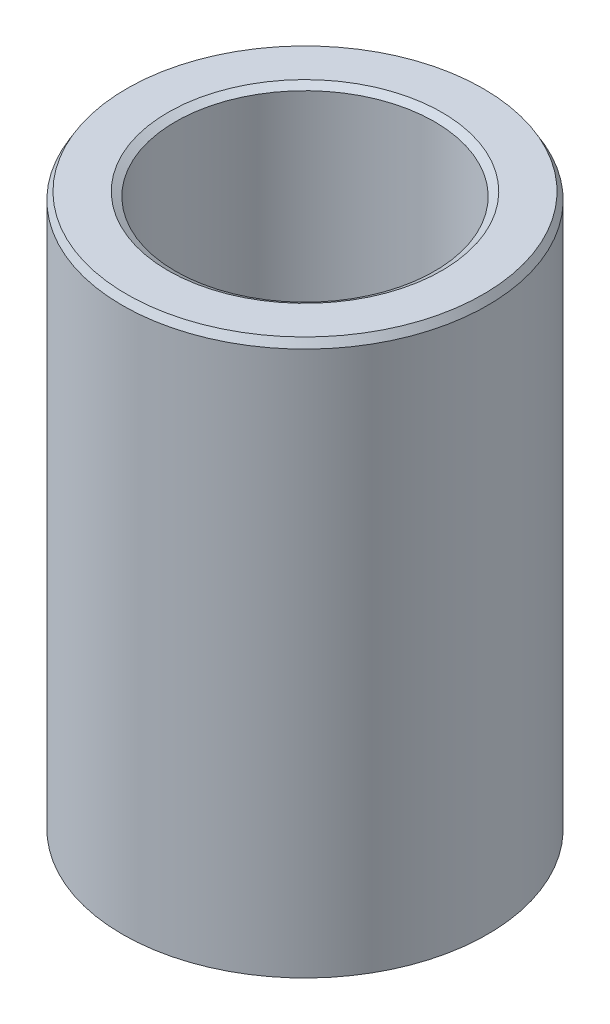
ISO-10303-21;
HEADER;
FILE_DESCRIPTION(('STEP AP214'),'2;1');
FILE_NAME('part.step','',(''),(''),'','','');
FILE_SCHEMA(('AUTOMOTIVE_DESIGN { 1 0 10303 214 1 1 1 1 }'));
ENDSEC;
DATA;
#1=APPLICATION_CONTEXT('core data for automotive mechanical design processes');
#2=APPLICATION_PROTOCOL_DEFINITION('international standard','automotive_design',2000,#1);
#3=PRODUCT_CONTEXT('',#1,'mechanical');
#4=PRODUCT('Part','Part','',(#3));
#5=PRODUCT_RELATED_PRODUCT_CATEGORY('part','',(#4));
#6=PRODUCT_DEFINITION_FORMATION('','',#4);
#7=PRODUCT_DEFINITION_CONTEXT('part definition',#1,'design');
#8=PRODUCT_DEFINITION('design','',#6,#7);
#9=PRODUCT_DEFINITION_SHAPE('','',#8);
#10=(LENGTH_UNIT() NAMED_UNIT(*) SI_UNIT(.MILLI.,.METRE.));
#11=(NAMED_UNIT(*) PLANE_ANGLE_UNIT() SI_UNIT($,.RADIAN.));
#12=(NAMED_UNIT(*) SI_UNIT($,.STERADIAN.) SOLID_ANGLE_UNIT());
#13=UNCERTAINTY_MEASURE_WITH_UNIT(LENGTH_MEASURE(1.E-05),#10,'distance_accuracy_value','');
#14=(GEOMETRIC_REPRESENTATION_CONTEXT(3) GLOBAL_UNCERTAINTY_ASSIGNED_CONTEXT((#13)) GLOBAL_UNIT_ASSIGNED_CONTEXT((#10,
#11,#12)) REPRESENTATION_CONTEXT('',''));
#15=CARTESIAN_POINT('',(0.,0.,0.));
#16=DIRECTION('',(0.,0.,1.));
#17=DIRECTION('',(1.,0.,0.));
#18=AXIS2_PLACEMENT_3D('',#15,#16,#17);
#19=CARTESIAN_POINT('',(0.,60.9600163009344,0.));
#20=DIRECTION('',(0.,-1.,0.));
#21=DIRECTION('',(0.,0.,-1.));
#22=AXIS2_PLACEMENT_3D('',#19,#20,#21);
#23=CYLINDRICAL_SURFACE('',#22,20.);
#24=CARTESIAN_POINT('',(0.,0.472863815361525,0.));
#25=DIRECTION('',(0.,1.,0.));
#26=DIRECTION('',(0.,0.,1.));
#27=AXIS2_PLACEMENT_3D('',#24,#25,#26);
#28=CIRCLE('',#27,20.);
#29=CARTESIAN_POINT('',(0.,0.472863815361525,20.));
#30=VERTEX_POINT('',#29);
#31=EDGE_CURVE('E10',#30,#30,#28,.T.);
#32=ORIENTED_EDGE('',*,*,#31,.T.);
#33=EDGE_LOOP('',(#32));
#34=FACE_BOUND('',#33,.T.);
#35=CARTESIAN_POINT('',(0.,60.1409921476673,0.));
#36=DIRECTION('',(0.,1.,0.));
#37=DIRECTION('',(0.,0.,1.));
#38=AXIS2_PLACEMENT_3D('',#35,#36,#37);
#39=CIRCLE('',#38,20.);
#40=CARTESIAN_POINT('',(0.,60.1409921476673,-20.));
#41=VERTEX_POINT('',#40);
#42=EDGE_CURVE('E50',#41,#41,#39,.F.);
#43=ORIENTED_EDGE('',*,*,#42,.T.);
#44=EDGE_LOOP('',(#43));
#45=FACE_BOUND('',#44,.T.);
#46=ADVANCED_FACE('F39',(#34,#45),#23,.T.);
#47=CARTESIAN_POINT('',(0.,60.9600163009344,0.));
#48=DIRECTION('',(0.,1.,0.));
#49=DIRECTION('',(0.,0.,1.));
#50=AXIS2_PLACEMENT_3D('',#47,#48,#49);
#51=PLANE('',#50);
#52=CARTESIAN_POINT('',(0.,60.9600163009344,0.));
#53=DIRECTION('',(0.,1.,0.));
#54=DIRECTION('',(0.,0.,1.));
#55=AXIS2_PLACEMENT_3D('',#52,#53,#54);
#56=CIRCLE('',#55,15.0113617959126);
#57=CARTESIAN_POINT('',(0.,60.9600163009344,15.0113617959126));
#58=VERTEX_POINT('',#57);
#59=EDGE_CURVE('E58',#58,#58,#56,.F.);
#60=ORIENTED_EDGE('',*,*,#59,.T.);
#61=EDGE_LOOP('',(#60));
#62=FACE_BOUND('',#61,.T.);
#63=CARTESIAN_POINT('',(0.,60.9600163009344,0.));
#64=DIRECTION('',(0.,1.,0.));
#65=DIRECTION('',(0.,0.,1.));
#66=AXIS2_PLACEMENT_3D('',#63,#64,#65);
#67=CIRCLE('',#66,19.5271361846385);
#68=CARTESIAN_POINT('',(0.,60.9600163009344,-19.5271361846385));
#69=VERTEX_POINT('',#68);
#70=EDGE_CURVE('E61',#69,#69,#67,.T.);
#71=ORIENTED_EDGE('',*,*,#70,.T.);
#72=EDGE_LOOP('',(#71));
#73=FACE_BOUND('',#72,.T.);
#74=ADVANCED_FACE('F88',(#62,#73),#51,.T.);
#75=CARTESIAN_POINT('',(0.,0.,0.));
#76=DIRECTION('',(0.,1.,0.));
#77=DIRECTION('',(0.,0.,1.));
#78=AXIS2_PLACEMENT_3D('',#75,#76,#77);
#79=PLANE('',#78);
#80=CARTESIAN_POINT('',(0.,0.,0.));
#81=DIRECTION('',(0.,1.,0.));
#82=DIRECTION('',(0.,0.,1.));
#83=AXIS2_PLACEMENT_3D('',#80,#81,#82);
#84=CIRCLE('',#83,14.6652014580071);
#85=CARTESIAN_POINT('',(0.,0.,-14.6652014580071));
#86=VERTEX_POINT('',#85);
#87=EDGE_CURVE('E51',#86,#86,#84,.T.);
#88=ORIENTED_EDGE('',*,*,#87,.T.);
#89=EDGE_LOOP('',(#88));
#90=FACE_BOUND('',#89,.T.);
#91=CARTESIAN_POINT('',(0.,0.,0.));
#92=DIRECTION('',(0.,1.,0.));
#93=DIRECTION('',(0.,0.,1.));
#94=AXIS2_PLACEMENT_3D('',#91,#92,#93);
#95=CIRCLE('',#94,19.180975846733);
#96=CARTESIAN_POINT('',(0.,0.,19.180975846733));
#97=VERTEX_POINT('',#96);
#98=EDGE_CURVE('E54',#97,#97,#95,.F.);
#99=ORIENTED_EDGE('',*,*,#98,.T.);
#100=EDGE_LOOP('',(#99));
#101=FACE_BOUND('',#100,.T.);
#102=ADVANCED_FACE('F83',(#90,#101),#79,.F.);
#103=CARTESIAN_POINT('',(0.,60.9600163009344,0.));
#104=DIRECTION('',(0.,-1.,0.));
#105=DIRECTION('',(0.,0.,-1.));
#106=AXIS2_PLACEMENT_3D('',#103,#104,#105);
#107=CYLINDRICAL_SURFACE('',#106,14.1923376426456);
#108=CARTESIAN_POINT('',(0.,60.4871524855729,0.));
#109=DIRECTION('',(0.,1.,0.));
#110=DIRECTION('',(0.,0.,1.));
#111=AXIS2_PLACEMENT_3D('',#108,#109,#110);
#112=CIRCLE('',#111,14.1923376426456);
#113=CARTESIAN_POINT('',(0.,60.4871524855729,14.1923376426456));
#114=VERTEX_POINT('',#113);
#115=EDGE_CURVE('E67',#114,#114,#112,.T.);
#116=ORIENTED_EDGE('',*,*,#115,.T.);
#117=EDGE_LOOP('',(#116));
#118=FACE_BOUND('',#117,.T.);
#119=CARTESIAN_POINT('',(0.,0.819024153267053,0.));
#120=DIRECTION('',(0.,1.,0.));
#121=DIRECTION('',(0.,0.,1.));
#122=AXIS2_PLACEMENT_3D('',#119,#120,#121);
#123=CIRCLE('',#122,14.1923376426456);
#124=CARTESIAN_POINT('',(0.,0.819024153267053,-14.1923376426456));
#125=VERTEX_POINT('',#124);
#126=EDGE_CURVE('E69',#125,#125,#123,.F.);
#127=ORIENTED_EDGE('',*,*,#126,.T.);
#128=EDGE_LOOP('',(#127));
#129=FACE_BOUND('',#128,.T.);
#130=ADVANCED_FACE('F71',(#118,#129),#107,.F.);
#131=CARTESIAN_POINT('',(0.,60.4871524855729,0.));
#132=DIRECTION('',(0.,1.,0.));
#133=DIRECTION('',(0.,0.,1.));
#134=AXIS2_PLACEMENT_3D('',#131,#132,#133);
#135=CONICAL_SURFACE('',#134,14.1923376426456,1.0471975511966);
#136=ORIENTED_EDGE('',*,*,#59,.F.);
#137=EDGE_LOOP('',(#136));
#138=FACE_BOUND('',#137,.T.);
#139=ORIENTED_EDGE('',*,*,#115,.F.);
#140=EDGE_LOOP('',(#139));
#141=FACE_BOUND('',#140,.T.);
#142=ADVANCED_FACE('F77',(#138,#141),#135,.F.);
#143=CARTESIAN_POINT('',(0.,0.,0.));
#144=DIRECTION('',(0.,-1.,0.));
#145=DIRECTION('',(0.,0.,-1.));
#146=AXIS2_PLACEMENT_3D('',#143,#144,#145);
#147=CONICAL_SURFACE('',#146,14.6652014580071,0.523598775598293);
#148=CARTESIAN_POINT('',(0.,0.819024153267053,-14.1923376426456));
#149=CARTESIAN_POINT('',(0.,0.810492651670521,-14.197263307389));
#150=CARTESIAN_POINT('',(0.,0.80196115007399,-14.2021889721323));
#151=CARTESIAN_POINT('',(0.,0.784898146880926,-14.212040301619));
#152=CARTESIAN_POINT('',(0.,0.776366645284394,-14.2169659663624));
#153=CARTESIAN_POINT('',(0.,0.759303642091331,-14.2268172958491));
#154=CARTESIAN_POINT('',(0.,0.750772140494799,-14.2317429605924));
#155=CARTESIAN_POINT('',(0.,0.733709137301735,-14.2415942900791));
#156=CARTESIAN_POINT('',(0.,0.725177635705203,-14.2465199548225));
#157=CARTESIAN_POINT('',(0.,0.70811463251214,-14.2563712843092));
#158=CARTESIAN_POINT('',(0.,0.699583130915608,-14.2612969490525));
#159=CARTESIAN_POINT('',(0.,0.682520127722544,-14.2711482785392));
#160=CARTESIAN_POINT('',(0.,0.673988626126013,-14.2760739432826));
#161=CARTESIAN_POINT('',(0.,0.656925622932949,-14.2859252727693));
#162=CARTESIAN_POINT('',(0.,0.648394121336417,-14.2908509375126));
#163=CARTESIAN_POINT('',(0.,0.631331118143353,-14.3007022669993));
#164=CARTESIAN_POINT('',(0.,0.622799616546822,-14.3056279317427));
#165=CARTESIAN_POINT('',(0.,0.605736613353758,-14.3154792612293));
#166=CARTESIAN_POINT('',(0.,0.597205111757226,-14.3204049259727));
#167=CARTESIAN_POINT('',(0.,0.580142108564163,-14.3302562554594));
#168=CARTESIAN_POINT('',(0.,0.571610606967631,-14.3351819202027));
#169=CARTESIAN_POINT('',(0.,0.554547603774567,-14.3450332496894));
#170=CARTESIAN_POINT('',(0.,0.546016102178035,-14.3499589144328));
#171=CARTESIAN_POINT('',(0.,0.528953098984972,-14.3598102439195));
#172=CARTESIAN_POINT('',(0.,0.52042159738844,-14.3647359086628));
#173=CARTESIAN_POINT('',(0.,0.503358594195377,-14.3745872381495));
#174=CARTESIAN_POINT('',(0.,0.494827092598845,-14.3795129028929));
#175=CARTESIAN_POINT('',(0.,0.477764089405781,-14.3893642323796));
#176=CARTESIAN_POINT('',(0.,0.469232587809249,-14.3942898971229));
#177=CARTESIAN_POINT('',(0.,0.452169584616185,-14.4041412266096));
#178=CARTESIAN_POINT('',(0.,0.443638083019654,-14.409066891353));
#179=CARTESIAN_POINT('',(0.,0.42657507982659,-14.4189182208397));
#180=CARTESIAN_POINT('',(0.,0.418043578230058,-14.423843885583));
#181=CARTESIAN_POINT('',(0.,0.400980575036995,-14.4336952150697));
#182=CARTESIAN_POINT('',(0.,0.392449073440463,-14.4386208798131));
#183=CARTESIAN_POINT('',(0.,0.375386070247399,-14.4484722092998));
#184=CARTESIAN_POINT('',(0.,0.366854568650868,-14.4533978740431));
#185=CARTESIAN_POINT('',(0.,0.349791565457804,-14.4632492035298));
#186=CARTESIAN_POINT('',(0.,0.341260063861272,-14.4681748682732));
#187=CARTESIAN_POINT('',(0.,0.324197060668208,-14.4780261977599));
#188=CARTESIAN_POINT('',(0.,0.315665559071677,-14.4829518625032));
#189=CARTESIAN_POINT('',(0.,0.298602555878613,-14.4928031919899));
#190=CARTESIAN_POINT('',(0.,0.290071054282082,-14.4977288567333));
#191=CARTESIAN_POINT('',(0.,0.273008051089018,-14.50758018622));
#192=CARTESIAN_POINT('',(0.,0.264476549492486,-14.5125058509633));
#193=CARTESIAN_POINT('',(0.,0.247413546299422,-14.52235718045));
#194=CARTESIAN_POINT('',(0.,0.23888204470289,-14.5272828451934));
#195=CARTESIAN_POINT('',(0.,0.221819041509827,-14.5371341746801));
#196=CARTESIAN_POINT('',(0.,0.213287539913295,-14.5420598394234));
#197=CARTESIAN_POINT('',(0.,0.196224536720231,-14.5519111689101));
#198=CARTESIAN_POINT('',(0.,0.1876930351237,-14.5568368336535));
#199=CARTESIAN_POINT('',(0.,0.170630031930636,-14.5666881631402));
#200=CARTESIAN_POINT('',(0.,0.162098530334104,-14.5716138278835));
#201=CARTESIAN_POINT('',(0.,0.145035527141041,-14.5814651573702));
#202=CARTESIAN_POINT('',(0.,0.136504025544509,-14.5863908221136));
#203=CARTESIAN_POINT('',(0.,0.119441022351445,-14.5962421516003));
#204=CARTESIAN_POINT('',(0.,0.110909520754913,-14.6011678163436));
#205=CARTESIAN_POINT('',(0.,0.0938465175618499,-14.6110191458303));
#206=CARTESIAN_POINT('',(0.,0.085315015965318,-14.6159448105737));
#207=CARTESIAN_POINT('',(0.,0.0682520127722545,-14.6257961400604));
#208=CARTESIAN_POINT('',(0.,0.0597205111757228,-14.6307218048037));
#209=CARTESIAN_POINT('',(0.,0.0426575079826591,-14.6405731342904));
#210=CARTESIAN_POINT('',(0.,0.0341260063861272,-14.6454987990338));
#211=CARTESIAN_POINT('',(0.,0.0170630031930634,-14.6553501285204));
#212=CARTESIAN_POINT('',(0.,0.00853150159653144,-14.6602757932638));
#213=CARTESIAN_POINT('',(0.,0.,-14.6652014580071));
#214=B_SPLINE_CURVE_WITH_KNOTS('',3,(#148,#149,#150,#151,#152,#153,#154,#155,#156,#157,#158,
#159,#160,#161,#162,#163,#164,#165,#166,#167,#168,#169,#170,#171,#172,#173,#174,#175,#176,#177,
#178,#179,#180,#181,#182,#183,#184,#185,#186,#187,#188,#189,#190,#191,#192,#193,#194,#195,#196,
#197,#198,#199,#200,#201,#202,#203,#204,#205,#206,#207,#208,#209,#210,#211,#212,#213),
.UNSPECIFIED.,.F.,.F.,(4,2,2,2,2,2,2,2,2,2,2,2,2,2,2,2,2,2,2,2,2,2,2,2,2,2,2,2,2,2,2,2,4),(0.,
0.0295539884600963,0.0591079769201926,0.088661965380288,0.118215953840384,0.147769942300481,
0.177323930760577,0.206877919220672,0.236431907680768,0.265985896140865,0.295539884600961,
0.325093873061057,0.354647861521153,0.384201849981249,0.413755838441345,0.443309826901441,
0.472863815361537,0.502417803821633,0.53197179228173,0.561525780741825,0.591079769201921,
0.620633757662018,0.650187746122113,0.67974173458221,0.709295723042306,0.738849711502402,
0.768403699962498,0.797957688422594,0.82751167688269,0.857065665342786,0.886619653802883,
0.916173642262978,0.945727630723075),.UNSPECIFIED.);
#215=EDGE_CURVE('BSEAM73',#125,#86,#214,.T.);
#216=ORIENTED_EDGE('',*,*,#126,.F.);
#217=ORIENTED_EDGE('',*,*,#87,.F.);
#218=ORIENTED_EDGE('',*,*,#215,.T.);
#219=ORIENTED_EDGE('',*,*,#215,.F.);
#220=EDGE_LOOP('',(#216,#218,#217,#219));
#221=FACE_BOUND('',#220,.T.);
#222=ADVANCED_FACE('F73',(#221),#147,.F.);
#223=CARTESIAN_POINT('',(0.,0.472863815361525,0.));
#224=DIRECTION('',(0.,1.,0.));
#225=DIRECTION('',(0.,0.,1.));
#226=AXIS2_PLACEMENT_3D('',#223,#224,#225);
#227=CONICAL_SURFACE('',#226,20.,1.0471975511966);
#228=ORIENTED_EDGE('',*,*,#98,.F.);
#229=EDGE_LOOP('',(#228));
#230=FACE_BOUND('',#229,.T.);
#231=ORIENTED_EDGE('',*,*,#31,.F.);
#232=EDGE_LOOP('',(#231));
#233=FACE_BOUND('',#232,.T.);
#234=ADVANCED_FACE('F76',(#230,#233),#227,.T.);
#235=CARTESIAN_POINT('',(0.,60.9600163009344,0.));
#236=DIRECTION('',(0.,-1.,0.));
#237=DIRECTION('',(0.,0.,-1.));
#238=AXIS2_PLACEMENT_3D('',#235,#236,#237);
#239=CONICAL_SURFACE('',#238,19.5271361846385,0.52359877559829);
#240=CARTESIAN_POINT('',(0.,60.1409921476673,-20.));
#241=CARTESIAN_POINT('',(0.,60.1495236492639,-19.9950743352567));
#242=CARTESIAN_POINT('',(0.,60.1580551508604,-19.9901486705133));
#243=CARTESIAN_POINT('',(0.,60.1751181540535,-19.9802973410266));
#244=CARTESIAN_POINT('',(0.,60.18364965565,-19.9753716762833));
#245=CARTESIAN_POINT('',(0.,60.2007126588431,-19.9655203467966));
#246=CARTESIAN_POINT('',(0.,60.2092441604396,-19.9605946820532));
#247=CARTESIAN_POINT('',(0.,60.2263071636327,-19.9507433525665));
#248=CARTESIAN_POINT('',(0.,60.2348386652292,-19.9458176878232));
#249=CARTESIAN_POINT('',(0.,60.2519016684223,-19.9359663583365));
#250=CARTESIAN_POINT('',(0.,60.2604331700188,-19.9310406935931));
#251=CARTESIAN_POINT('',(0.,60.2774961732119,-19.9211893641064));
#252=CARTESIAN_POINT('',(0.,60.2860276748084,-19.9162636993631));
#253=CARTESIAN_POINT('',(0.,60.3030906780015,-19.9064123698764));
#254=CARTESIAN_POINT('',(0.,60.311622179598,-19.901486705133));
#255=CARTESIAN_POINT('',(0.,60.328685182791,-19.8916353756463));
#256=CARTESIAN_POINT('',(0.,60.3372166843876,-19.886709710903));
#257=CARTESIAN_POINT('',(0.,60.3542796875806,-19.8768583814163));
#258=CARTESIAN_POINT('',(0.,60.3628111891772,-19.8719327166729));
#259=CARTESIAN_POINT('',(0.,60.3798741923702,-19.8620813871862));
#260=CARTESIAN_POINT('',(0.,60.3884056939668,-19.8571557224429));
#261=CARTESIAN_POINT('',(0.,60.4054686971598,-19.8473043929562));
#262=CARTESIAN_POINT('',(0.,60.4140001987564,-19.8423787282128));
#263=CARTESIAN_POINT('',(0.,60.4310632019494,-19.8325273987261));
#264=CARTESIAN_POINT('',(0.,60.439594703546,-19.8276017339828));
#265=CARTESIAN_POINT('',(0.,60.456657706739,-19.8177504044961));
#266=CARTESIAN_POINT('',(0.,60.4651892083356,-19.8128247397527));
#267=CARTESIAN_POINT('',(0.,60.4822522115286,-19.802973410266));
#268=CARTESIAN_POINT('',(0.,60.4907837131251,-19.7980477455227));
#269=CARTESIAN_POINT('',(0.,60.5078467163182,-19.788196416036));
#270=CARTESIAN_POINT('',(0.,60.5163782179147,-19.7832707512926));
#271=CARTESIAN_POINT('',(0.,60.5334412211078,-19.7734194218059));
#272=CARTESIAN_POINT('',(0.,60.5419727227043,-19.7684937570626));
#273=CARTESIAN_POINT('',(0.,60.5590357258974,-19.7586424275759));
#274=CARTESIAN_POINT('',(0.,60.5675672274939,-19.7537167628325));
#275=CARTESIAN_POINT('',(0.,60.584630230687,-19.7438654333458));
#276=CARTESIAN_POINT('',(0.,60.5931617322835,-19.7389397686025));
#277=CARTESIAN_POINT('',(0.,60.6102247354766,-19.7290884391158));
#278=CARTESIAN_POINT('',(0.,60.6187562370731,-19.7241627743724));
#279=CARTESIAN_POINT('',(0.,60.6358192402662,-19.7143114448857));
#280=CARTESIAN_POINT('',(0.,60.6443507418627,-19.7093857801424));
#281=CARTESIAN_POINT('',(0.,60.6614137450558,-19.6995344506557));
#282=CARTESIAN_POINT('',(0.,60.6699452466523,-19.6946087859123));
#283=CARTESIAN_POINT('',(0.,60.6870082498454,-19.6847574564256));
#284=CARTESIAN_POINT('',(0.,60.6955397514419,-19.6798317916823));
#285=CARTESIAN_POINT('',(0.,60.712602754635,-19.6699804621956));
#286=CARTESIAN_POINT('',(0.,60.7211342562315,-19.6650547974523));
#287=CARTESIAN_POINT('',(0.,60.7381972594246,-19.6552034679656));
#288=CARTESIAN_POINT('',(0.,60.7467287610211,-19.6502778032222));
#289=CARTESIAN_POINT('',(0.,60.7637917642142,-19.6404264737355));
#290=CARTESIAN_POINT('',(0.,60.7723232658107,-19.6355008089922));
#291=CARTESIAN_POINT('',(0.,60.7893862690038,-19.6256494795055));
#292=CARTESIAN_POINT('',(0.,60.7979177706003,-19.6207238147621));
#293=CARTESIAN_POINT('',(0.,60.8149807737934,-19.6108724852754));
#294=CARTESIAN_POINT('',(0.,60.8235122753899,-19.6059468205321));
#295=CARTESIAN_POINT('',(0.,60.840575278583,-19.5960954910454));
#296=CARTESIAN_POINT('',(0.,60.8491067801795,-19.591169826302));
#297=CARTESIAN_POINT('',(0.,60.8661697833726,-19.5813184968153));
#298=CARTESIAN_POINT('',(0.,60.8747012849691,-19.576392832072));
#299=CARTESIAN_POINT('',(0.,60.8917642881622,-19.5665415025853));
#300=CARTESIAN_POINT('',(0.,60.9002957897587,-19.5616158378419));
#301=CARTESIAN_POINT('',(0.,60.9173587929517,-19.5517645083552));
#302=CARTESIAN_POINT('',(0.,60.9258902945483,-19.5468388436119));
#303=CARTESIAN_POINT('',(0.,60.9429532977413,-19.5369875141252));
#304=CARTESIAN_POINT('',(0.,60.9514847993379,-19.5320618493818));
#305=CARTESIAN_POINT('',(0.,60.9600163009344,-19.5271361846385));
#306=B_SPLINE_CURVE_WITH_KNOTS('',3,(#240,#241,#242,#243,#244,#245,#246,#247,#248,#249,#250,
#251,#252,#253,#254,#255,#256,#257,#258,#259,#260,#261,#262,#263,#264,#265,#266,#267,#268,#269,
#270,#271,#272,#273,#274,#275,#276,#277,#278,#279,#280,#281,#282,#283,#284,#285,#286,#287,#288,
#289,#290,#291,#292,#293,#294,#295,#296,#297,#298,#299,#300,#301,#302,#303,#304,#305),
.UNSPECIFIED.,.F.,.F.,(4,2,2,2,2,2,2,2,2,2,2,2,2,2,2,2,2,2,2,2,2,2,2,2,2,2,2,2,2,2,2,2,4),(0.,
0.0295539884600915,0.0591079769201873,0.0886619653802831,0.118215953840381,0.147769942300476,
0.177323930760572,0.20687791922067,0.236431907680766,0.265985896140863,0.295539884600959,
0.325093873061055,0.354647861521152,0.384201849981248,0.413755838441344,0.443309826901441,
0.472863815361537,0.502417803821627,0.531971792281724,0.56152578074182,0.591079769201916,
0.620633757662013,0.650187746122109,0.679741734582205,0.709295723042302,0.738849711502398,
0.768403699962494,0.797957688422591,0.827511676882687,0.857065665342783,0.88661965380288,
0.916173642262976,0.945727630723072),.UNSPECIFIED.);
#307=EDGE_CURVE('BSEAM45',#41,#69,#306,.T.);
#308=ORIENTED_EDGE('',*,*,#42,.F.);
#309=ORIENTED_EDGE('',*,*,#70,.F.);
#310=ORIENTED_EDGE('',*,*,#307,.T.);
#311=ORIENTED_EDGE('',*,*,#307,.F.);
#312=EDGE_LOOP('',(#308,#310,#309,#311));
#313=FACE_BOUND('',#312,.T.);
#314=ADVANCED_FACE('F45',(#313),#239,.T.);
#315=CLOSED_SHELL('',(#46,#74,#102,#130,#142,#222,#234,#314));
#316=MANIFOLD_SOLID_BREP('B2',#315);
#317=ADVANCED_BREP_SHAPE_REPRESENTATION('',(#18,#316),#14);
#318=SHAPE_DEFINITION_REPRESENTATION(#9,#317);
ENDSEC;
END-ISO-10303-21;
